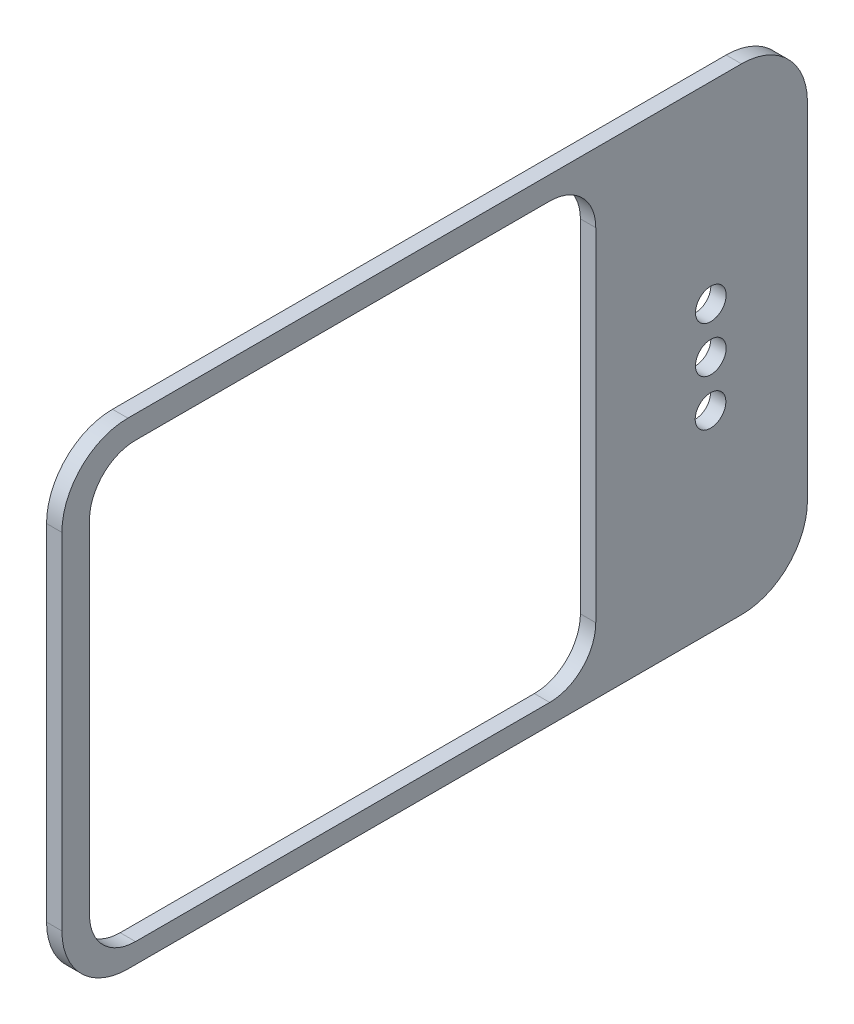
ISO-10303-21;
HEADER;
FILE_DESCRIPTION(('STEP AP214'),'2;1');
FILE_NAME('part.step','',(''),(''),'','','');
FILE_SCHEMA(('AUTOMOTIVE_DESIGN { 1 0 10303 214 1 1 1 1 }'));
ENDSEC;
DATA;
#1=APPLICATION_CONTEXT('core data for automotive mechanical design processes');
#2=APPLICATION_PROTOCOL_DEFINITION('international standard','automotive_design',2000,#1);
#3=PRODUCT_CONTEXT('',#1,'mechanical');
#4=PRODUCT('Part','Part','',(#3));
#5=PRODUCT_RELATED_PRODUCT_CATEGORY('part','',(#4));
#6=PRODUCT_DEFINITION_FORMATION('','',#4);
#7=PRODUCT_DEFINITION_CONTEXT('part definition',#1,'design');
#8=PRODUCT_DEFINITION('design','',#6,#7);
#9=PRODUCT_DEFINITION_SHAPE('','',#8);
#10=(LENGTH_UNIT() NAMED_UNIT(*) SI_UNIT(.MILLI.,.METRE.));
#11=(NAMED_UNIT(*) PLANE_ANGLE_UNIT() SI_UNIT($,.RADIAN.));
#12=(NAMED_UNIT(*) SI_UNIT($,.STERADIAN.) SOLID_ANGLE_UNIT());
#13=UNCERTAINTY_MEASURE_WITH_UNIT(LENGTH_MEASURE(1.E-05),#10,'distance_accuracy_value','');
#14=(GEOMETRIC_REPRESENTATION_CONTEXT(3) GLOBAL_UNCERTAINTY_ASSIGNED_CONTEXT((#13)) GLOBAL_UNIT_ASSIGNED_CONTEXT((#10,
#11,#12)) REPRESENTATION_CONTEXT('',''));
#15=CARTESIAN_POINT('',(0.,0.,0.));
#16=DIRECTION('',(0.,0.,1.));
#17=DIRECTION('',(1.,0.,0.));
#18=AXIS2_PLACEMENT_3D('',#15,#16,#17);
#19=CARTESIAN_POINT('',(1.,-1.74753460069684,-22.5098061573546));
#20=DIRECTION('',(-1.,0.,0.));
#21=DIRECTION('',(0.,0.,1.));
#22=AXIS2_PLACEMENT_3D('',#19,#20,#21);
#23=CYLINDRICAL_SURFACE('',#22,4.3);
#24=CARTESIAN_POINT('',(0.,-1.74753460069684,-22.5098061573546));
#25=DIRECTION('',(1.,0.,0.));
#26=DIRECTION('',(0.,0.,-1.));
#27=AXIS2_PLACEMENT_3D('',#24,#25,#26);
#28=CIRCLE('',#27,4.3);
#29=CARTESIAN_POINT('',(0.,-6.04753460069684,-22.5098061573546));
#30=VERTEX_POINT('',#29);
#31=CARTESIAN_POINT('',(0.,-1.74753460069684,-26.8098061573546));
#32=VERTEX_POINT('',#31);
#33=EDGE_CURVE('E212',#30,#32,#28,.T.);
#34=ORIENTED_EDGE('',*,*,#33,.T.);
#35=DIRECTION('',(-1.,0.,0.));
#36=VECTOR('',#35,1.);
#37=CARTESIAN_POINT('',(1.,-1.74753460069684,-26.8098061573546));
#38=LINE('',#37,#36);
#39=CARTESIAN_POINT('',(1.,-1.74753460069684,-26.8098061573546));
#40=VERTEX_POINT('',#39);
#41=EDGE_CURVE('E11',#40,#32,#38,.T.);
#42=ORIENTED_EDGE('',*,*,#41,.F.);
#43=CARTESIAN_POINT('',(1.,-1.74753460069684,-22.5098061573546));
#44=DIRECTION('',(1.,0.,0.));
#45=DIRECTION('',(0.,0.,-1.));
#46=AXIS2_PLACEMENT_3D('',#43,#44,#45);
#47=CIRCLE('',#46,4.3);
#48=CARTESIAN_POINT('',(1.,-6.04753460069684,-22.5098061573546));
#49=VERTEX_POINT('',#48);
#50=EDGE_CURVE('E224',#49,#40,#47,.T.);
#51=ORIENTED_EDGE('',*,*,#50,.F.);
#52=DIRECTION('',(-1.,0.,0.));
#53=VECTOR('',#52,1.);
#54=CARTESIAN_POINT('',(1.,-6.04753460069684,-22.5098061573546));
#55=LINE('',#54,#53);
#56=EDGE_CURVE('E242',#49,#30,#55,.T.);
#57=ORIENTED_EDGE('',*,*,#56,.T.);
#58=EDGE_LOOP('',(#34,#42,#51,#57));
#59=FACE_BOUND('',#58,.T.);
#60=ADVANCED_FACE('F39',(#59),#23,.T.);
#61=CARTESIAN_POINT('',(1.,-1.74753460069684,-26.8098061573546));
#62=DIRECTION('',(0.,0.,1.));
#63=DIRECTION('',(0.,-1.,0.));
#64=AXIS2_PLACEMENT_3D('',#61,#62,#63);
#65=PLANE('',#64);
#66=DIRECTION('',(0.,1.,0.));
#67=VECTOR('',#66,1.);
#68=CARTESIAN_POINT('',(0.,-1.74753460069684,-26.8098061573546));
#69=LINE('',#68,#67);
#70=CARTESIAN_POINT('',(0.,20.7524653993032,-26.8098061573546));
#71=VERTEX_POINT('',#70);
#72=EDGE_CURVE('E245',#32,#71,#69,.T.);
#73=ORIENTED_EDGE('',*,*,#72,.T.);
#74=DIRECTION('',(-1.,0.,0.));
#75=VECTOR('',#74,1.);
#76=CARTESIAN_POINT('',(1.,20.7524653993032,-26.8098061573546));
#77=LINE('',#76,#75);
#78=CARTESIAN_POINT('',(1.,20.7524653993032,-26.8098061573546));
#79=VERTEX_POINT('',#78);
#80=EDGE_CURVE('E46',#79,#71,#77,.T.);
#81=ORIENTED_EDGE('',*,*,#80,.F.);
#82=DIRECTION('',(0.,1.,0.));
#83=VECTOR('',#82,1.);
#84=CARTESIAN_POINT('',(1.,-1.74753460069684,-26.8098061573546));
#85=LINE('',#84,#83);
#86=EDGE_CURVE('E227',#40,#79,#85,.T.);
#87=ORIENTED_EDGE('',*,*,#86,.F.);
#88=ORIENTED_EDGE('',*,*,#41,.T.);
#89=EDGE_LOOP('',(#73,#81,#87,#88));
#90=FACE_BOUND('',#89,.T.);
#91=ADVANCED_FACE('F300',(#90),#65,.F.);
#92=CARTESIAN_POINT('',(1.,20.7524653993032,-22.5098061573546));
#93=DIRECTION('',(-1.,0.,0.));
#94=DIRECTION('',(0.,0.,1.));
#95=AXIS2_PLACEMENT_3D('',#92,#93,#94);
#96=CYLINDRICAL_SURFACE('',#95,4.3);
#97=CARTESIAN_POINT('',(0.,20.7524653993032,-22.5098061573546));
#98=DIRECTION('',(1.,0.,0.));
#99=DIRECTION('',(0.,0.,-1.));
#100=AXIS2_PLACEMENT_3D('',#97,#98,#99);
#101=CIRCLE('',#100,4.3);
#102=CARTESIAN_POINT('',(0.,25.0524653993032,-22.5098061573546));
#103=VERTEX_POINT('',#102);
#104=EDGE_CURVE('E247',#71,#103,#101,.T.);
#105=ORIENTED_EDGE('',*,*,#104,.T.);
#106=DIRECTION('',(-1.,0.,0.));
#107=VECTOR('',#106,1.);
#108=CARTESIAN_POINT('',(1.,25.0524653993032,-22.5098061573546));
#109=LINE('',#108,#107);
#110=CARTESIAN_POINT('',(1.,25.0524653993032,-22.5098061573546));
#111=VERTEX_POINT('',#110);
#112=EDGE_CURVE('E272',#111,#103,#109,.T.);
#113=ORIENTED_EDGE('',*,*,#112,.F.);
#114=CARTESIAN_POINT('',(1.,20.7524653993032,-22.5098061573546));
#115=DIRECTION('',(1.,0.,0.));
#116=DIRECTION('',(0.,0.,-1.));
#117=AXIS2_PLACEMENT_3D('',#114,#115,#116);
#118=CIRCLE('',#117,4.3);
#119=EDGE_CURVE('E230',#79,#111,#118,.T.);
#120=ORIENTED_EDGE('',*,*,#119,.F.);
#121=ORIENTED_EDGE('',*,*,#80,.T.);
#122=EDGE_LOOP('',(#105,#113,#120,#121));
#123=FACE_BOUND('',#122,.T.);
#124=ADVANCED_FACE('F279',(#123),#96,.T.);
#125=CARTESIAN_POINT('',(1.,25.0524653993032,-22.5098061573546));
#126=DIRECTION('',(0.,-1.,0.));
#127=DIRECTION('',(0.,0.,-1.));
#128=AXIS2_PLACEMENT_3D('',#125,#126,#127);
#129=PLANE('',#128);
#130=DIRECTION('',(0.,0.,1.));
#131=VECTOR('',#130,1.);
#132=CARTESIAN_POINT('',(0.,25.0524653993032,-22.5098061573546));
#133=LINE('',#132,#131);
#134=CARTESIAN_POINT('',(0.,25.0524653993032,17.4901938426454));
#135=VERTEX_POINT('',#134);
#136=EDGE_CURVE('E249',#103,#135,#133,.T.);
#137=ORIENTED_EDGE('',*,*,#136,.T.);
#138=DIRECTION('',(-1.,0.,0.));
#139=VECTOR('',#138,1.);
#140=CARTESIAN_POINT('',(1.,25.0524653993032,17.4901938426454));
#141=LINE('',#140,#139);
#142=CARTESIAN_POINT('',(1.,25.0524653993032,17.4901938426454));
#143=VERTEX_POINT('',#142);
#144=EDGE_CURVE('E269',#143,#135,#141,.T.);
#145=ORIENTED_EDGE('',*,*,#144,.F.);
#146=DIRECTION('',(0.,0.,1.));
#147=VECTOR('',#146,1.);
#148=CARTESIAN_POINT('',(1.,25.0524653993032,-22.5098061573546));
#149=LINE('',#148,#147);
#150=EDGE_CURVE('E232',#111,#143,#149,.T.);
#151=ORIENTED_EDGE('',*,*,#150,.F.);
#152=ORIENTED_EDGE('',*,*,#112,.T.);
#153=EDGE_LOOP('',(#137,#145,#151,#152));
#154=FACE_BOUND('',#153,.T.);
#155=ADVANCED_FACE('F290',(#154),#129,.F.);
#156=CARTESIAN_POINT('',(1.,20.7524653993032,17.4901938426454));
#157=DIRECTION('',(-1.,0.,0.));
#158=DIRECTION('',(0.,0.,1.));
#159=AXIS2_PLACEMENT_3D('',#156,#157,#158);
#160=CYLINDRICAL_SURFACE('',#159,4.3);
#161=CARTESIAN_POINT('',(0.,20.7524653993032,17.4901938426454));
#162=DIRECTION('',(1.,0.,0.));
#163=DIRECTION('',(0.,0.,-1.));
#164=AXIS2_PLACEMENT_3D('',#161,#162,#163);
#165=CIRCLE('',#164,4.3);
#166=CARTESIAN_POINT('',(0.,20.7524653993032,21.7901938426454));
#167=VERTEX_POINT('',#166);
#168=EDGE_CURVE('E251',#135,#167,#165,.T.);
#169=ORIENTED_EDGE('',*,*,#168,.T.);
#170=DIRECTION('',(-1.,0.,0.));
#171=VECTOR('',#170,1.);
#172=CARTESIAN_POINT('',(1.,20.7524653993032,21.7901938426454));
#173=LINE('',#172,#171);
#174=CARTESIAN_POINT('',(1.,20.7524653993032,21.7901938426454));
#175=VERTEX_POINT('',#174);
#176=EDGE_CURVE('E266',#175,#167,#173,.T.);
#177=ORIENTED_EDGE('',*,*,#176,.F.);
#178=CARTESIAN_POINT('',(1.,20.7524653993032,17.4901938426454));
#179=DIRECTION('',(1.,0.,0.));
#180=DIRECTION('',(0.,0.,-1.));
#181=AXIS2_PLACEMENT_3D('',#178,#179,#180);
#182=CIRCLE('',#181,4.3);
#183=EDGE_CURVE('E234',#143,#175,#182,.T.);
#184=ORIENTED_EDGE('',*,*,#183,.F.);
#185=ORIENTED_EDGE('',*,*,#144,.T.);
#186=EDGE_LOOP('',(#169,#177,#184,#185));
#187=FACE_BOUND('',#186,.T.);
#188=ADVANCED_FACE('F294',(#187),#160,.T.);
#189=CARTESIAN_POINT('',(1.,20.7524653993032,21.7901938426454));
#190=DIRECTION('',(0.,0.,-1.));
#191=DIRECTION('',(-1.,0.,0.));
#192=AXIS2_PLACEMENT_3D('',#189,#190,#191);
#193=PLANE('',#192);
#194=DIRECTION('',(0.,-1.,0.));
#195=VECTOR('',#194,1.);
#196=CARTESIAN_POINT('',(0.,20.7524653993032,21.7901938426454));
#197=LINE('',#196,#195);
#198=CARTESIAN_POINT('',(0.,-1.74753460069685,21.7901938426454));
#199=VERTEX_POINT('',#198);
#200=EDGE_CURVE('E253',#167,#199,#197,.T.);
#201=ORIENTED_EDGE('',*,*,#200,.T.);
#202=DIRECTION('',(-1.,0.,0.));
#203=VECTOR('',#202,1.);
#204=CARTESIAN_POINT('',(1.,-1.74753460069685,21.7901938426454));
#205=LINE('',#204,#203);
#206=CARTESIAN_POINT('',(1.,-1.74753460069685,21.7901938426454));
#207=VERTEX_POINT('',#206);
#208=EDGE_CURVE('E263',#207,#199,#205,.T.);
#209=ORIENTED_EDGE('',*,*,#208,.F.);
#210=DIRECTION('',(0.,-1.,0.));
#211=VECTOR('',#210,1.);
#212=CARTESIAN_POINT('',(1.,20.7524653993032,21.7901938426454));
#213=LINE('',#212,#211);
#214=EDGE_CURVE('E236',#175,#207,#213,.T.);
#215=ORIENTED_EDGE('',*,*,#214,.F.);
#216=ORIENTED_EDGE('',*,*,#176,.T.);
#217=EDGE_LOOP('',(#201,#209,#215,#216));
#218=FACE_BOUND('',#217,.T.);
#219=ADVANCED_FACE('F313',(#218),#193,.F.);
#220=CARTESIAN_POINT('',(1.,-1.74753460069685,17.4901938426454));
#221=DIRECTION('',(-1.,0.,0.));
#222=DIRECTION('',(0.,0.,1.));
#223=AXIS2_PLACEMENT_3D('',#220,#221,#222);
#224=CYLINDRICAL_SURFACE('',#223,4.30000000000001);
#225=CARTESIAN_POINT('',(0.,-1.74753460069685,17.4901938426454));
#226=DIRECTION('',(1.,0.,0.));
#227=DIRECTION('',(0.,0.,-1.));
#228=AXIS2_PLACEMENT_3D('',#225,#226,#227);
#229=CIRCLE('',#228,4.30000000000001);
#230=CARTESIAN_POINT('',(0.,-6.04753460069685,17.4901938426454));
#231=VERTEX_POINT('',#230);
#232=EDGE_CURVE('E255',#199,#231,#229,.T.);
#233=ORIENTED_EDGE('',*,*,#232,.T.);
#234=DIRECTION('',(-1.,0.,0.));
#235=VECTOR('',#234,1.);
#236=CARTESIAN_POINT('',(1.,-6.04753460069685,17.4901938426454));
#237=LINE('',#236,#235);
#238=CARTESIAN_POINT('',(1.,-6.04753460069685,17.4901938426454));
#239=VERTEX_POINT('',#238);
#240=EDGE_CURVE('E260',#239,#231,#237,.T.);
#241=ORIENTED_EDGE('',*,*,#240,.F.);
#242=CARTESIAN_POINT('',(1.,-1.74753460069685,17.4901938426454));
#243=DIRECTION('',(1.,0.,0.));
#244=DIRECTION('',(0.,0.,-1.));
#245=AXIS2_PLACEMENT_3D('',#242,#243,#244);
#246=CIRCLE('',#245,4.30000000000001);
#247=EDGE_CURVE('E238',#207,#239,#246,.T.);
#248=ORIENTED_EDGE('',*,*,#247,.F.);
#249=ORIENTED_EDGE('',*,*,#208,.T.);
#250=EDGE_LOOP('',(#233,#241,#248,#249));
#251=FACE_BOUND('',#250,.T.);
#252=ADVANCED_FACE('F311',(#251),#224,.T.);
#253=CARTESIAN_POINT('',(1.,-6.04753460069685,17.4901938426454));
#254=DIRECTION('',(0.,1.,0.));
#255=DIRECTION('',(0.,0.,1.));
#256=AXIS2_PLACEMENT_3D('',#253,#254,#255);
#257=PLANE('',#256);
#258=DIRECTION('',(0.,0.,-1.));
#259=VECTOR('',#258,1.);
#260=CARTESIAN_POINT('',(0.,-6.04753460069685,17.4901938426454));
#261=LINE('',#260,#259);
#262=EDGE_CURVE('E228',#231,#30,#261,.T.);
#263=ORIENTED_EDGE('',*,*,#262,.T.);
#264=ORIENTED_EDGE('',*,*,#56,.F.);
#265=DIRECTION('',(0.,0.,-1.));
#266=VECTOR('',#265,1.);
#267=CARTESIAN_POINT('',(1.,-6.04753460069685,17.4901938426454));
#268=LINE('',#267,#266);
#269=EDGE_CURVE('E240',#239,#49,#268,.T.);
#270=ORIENTED_EDGE('',*,*,#269,.F.);
#271=ORIENTED_EDGE('',*,*,#240,.T.);
#272=EDGE_LOOP('',(#263,#264,#270,#271));
#273=FACE_BOUND('',#272,.T.);
#274=ADVANCED_FACE('F306',(#273),#257,.F.);
#275=CARTESIAN_POINT('',(1.,-1.74753460069684,-22.5098061573546));
#276=DIRECTION('',(1.,0.,0.));
#277=DIRECTION('',(0.,0.,-1.));
#278=AXIS2_PLACEMENT_3D('',#275,#276,#277);
#279=PLANE('',#278);
#280=CARTESIAN_POINT('',(1.,6.49433255645243,-20.4913205756208));
#281=DIRECTION('',(-1.,0.,0.));
#282=DIRECTION('',(0.,0.,1.));
#283=AXIS2_PLACEMENT_3D('',#280,#281,#282);
#284=CIRCLE('',#283,1.);
#285=CARTESIAN_POINT('',(1.,6.49433255645243,-19.4913205756208));
#286=VERTEX_POINT('',#285);
#287=EDGE_CURVE('E544',#286,#286,#284,.T.);
#288=ORIENTED_EDGE('',*,*,#287,.T.);
#289=EDGE_LOOP('',(#288));
#290=FACE_BOUND('',#289,.T.);
#291=CARTESIAN_POINT('',(1.,12.5024653993032,-20.5098061573546));
#292=DIRECTION('',(-1.,0.,0.));
#293=DIRECTION('',(0.,0.,1.));
#294=AXIS2_PLACEMENT_3D('',#291,#292,#293);
#295=CIRCLE('',#294,1.);
#296=CARTESIAN_POINT('',(1.,12.5024653993032,-19.5098061573546));
#297=VERTEX_POINT('',#296);
#298=EDGE_CURVE('E548',#297,#297,#295,.T.);
#299=ORIENTED_EDGE('',*,*,#298,.T.);
#300=EDGE_LOOP('',(#299));
#301=FACE_BOUND('',#300,.T.);
#302=CARTESIAN_POINT('',(1.,9.50246539930316,-20.5098061573546));
#303=DIRECTION('',(-1.,0.,0.));
#304=DIRECTION('',(0.,0.,1.));
#305=AXIS2_PLACEMENT_3D('',#302,#303,#304);
#306=CIRCLE('',#305,1.);
#307=CARTESIAN_POINT('',(1.,9.50246539930316,-19.5098061573546));
#308=VERTEX_POINT('',#307);
#309=EDGE_CURVE('E194',#308,#308,#306,.T.);
#310=ORIENTED_EDGE('',*,*,#309,.T.);
#311=EDGE_LOOP('',(#310));
#312=FACE_BOUND('',#311,.T.);
#313=CARTESIAN_POINT('',(1.,20.5524653993032,-10.0098061573546));
#314=DIRECTION('',(-1.,0.,0.));
#315=DIRECTION('',(0.,0.,1.));
#316=AXIS2_PLACEMENT_3D('',#313,#314,#315);
#317=CIRCLE('',#316,3.);
#318=CARTESIAN_POINT('',(1.,23.5524653993032,-10.0098061573546));
#319=VERTEX_POINT('',#318);
#320=CARTESIAN_POINT('',(1.,20.5524653993032,-13.0098061573546));
#321=VERTEX_POINT('',#320);
#322=EDGE_CURVE('E153',#319,#321,#317,.T.);
#323=ORIENTED_EDGE('',*,*,#322,.T.);
#324=DIRECTION('',(0.,-1.,0.));
#325=VECTOR('',#324,1.);
#326=CARTESIAN_POINT('',(1.,20.5524653993032,-13.0098061573546));
#327=LINE('',#326,#325);
#328=CARTESIAN_POINT('',(1.,-1.74753460069684,-13.0098061573546));
#329=VERTEX_POINT('',#328);
#330=EDGE_CURVE('E162',#321,#329,#327,.T.);
#331=ORIENTED_EDGE('',*,*,#330,.T.);
#332=CARTESIAN_POINT('',(1.,-1.74753460069684,-10.0098061573546));
#333=DIRECTION('',(-1.,0.,0.));
#334=DIRECTION('',(0.,0.,1.));
#335=AXIS2_PLACEMENT_3D('',#332,#333,#334);
#336=CIRCLE('',#335,3.);
#337=CARTESIAN_POINT('',(1.,-4.74753460069685,-10.0098061573546));
#338=VERTEX_POINT('',#337);
#339=EDGE_CURVE('E53',#329,#338,#336,.T.);
#340=ORIENTED_EDGE('',*,*,#339,.T.);
#341=DIRECTION('',(0.,0.,1.));
#342=VECTOR('',#341,1.);
#343=CARTESIAN_POINT('',(1.,-4.74753460069685,-10.0098061573546));
#344=LINE('',#343,#342);
#345=CARTESIAN_POINT('',(1.,-4.74753460069685,16.9901938426454));
#346=VERTEX_POINT('',#345);
#347=EDGE_CURVE('E180',#338,#346,#344,.T.);
#348=ORIENTED_EDGE('',*,*,#347,.T.);
#349=CARTESIAN_POINT('',(1.,-1.74753460069685,16.9901938426454));
#350=DIRECTION('',(-1.,0.,0.));
#351=DIRECTION('',(0.,0.,1.));
#352=AXIS2_PLACEMENT_3D('',#349,#350,#351);
#353=CIRCLE('',#352,3.);
#354=CARTESIAN_POINT('',(1.,-1.74753460069685,19.9901938426454));
#355=VERTEX_POINT('',#354);
#356=EDGE_CURVE('E183',#346,#355,#353,.T.);
#357=ORIENTED_EDGE('',*,*,#356,.T.);
#358=DIRECTION('',(0.,1.,0.));
#359=VECTOR('',#358,1.);
#360=CARTESIAN_POINT('',(1.,-1.74753460069685,19.9901938426454));
#361=LINE('',#360,#359);
#362=CARTESIAN_POINT('',(1.,20.5524653993032,19.9901938426454));
#363=VERTEX_POINT('',#362);
#364=EDGE_CURVE('E186',#355,#363,#361,.T.);
#365=ORIENTED_EDGE('',*,*,#364,.T.);
#366=CARTESIAN_POINT('',(1.,20.5524653993032,16.9901938426454));
#367=DIRECTION('',(-1.,0.,0.));
#368=DIRECTION('',(0.,0.,1.));
#369=AXIS2_PLACEMENT_3D('',#366,#367,#368);
#370=CIRCLE('',#369,3.);
#371=CARTESIAN_POINT('',(1.,23.5524653993032,16.9901938426454));
#372=VERTEX_POINT('',#371);
#373=EDGE_CURVE('E189',#363,#372,#370,.T.);
#374=ORIENTED_EDGE('',*,*,#373,.T.);
#375=DIRECTION('',(0.,0.,-1.));
#376=VECTOR('',#375,1.);
#377=CARTESIAN_POINT('',(1.,23.5524653993032,16.9901938426454));
#378=LINE('',#377,#376);
#379=EDGE_CURVE('E159',#372,#319,#378,.T.);
#380=ORIENTED_EDGE('',*,*,#379,.T.);
#381=EDGE_LOOP('',(#323,#331,#340,#348,#357,#365,#374,#380));
#382=FACE_BOUND('',#381,.T.);
#383=ORIENTED_EDGE('',*,*,#50,.T.);
#384=ORIENTED_EDGE('',*,*,#86,.T.);
#385=ORIENTED_EDGE('',*,*,#119,.T.);
#386=ORIENTED_EDGE('',*,*,#150,.T.);
#387=ORIENTED_EDGE('',*,*,#183,.T.);
#388=ORIENTED_EDGE('',*,*,#214,.T.);
#389=ORIENTED_EDGE('',*,*,#247,.T.);
#390=ORIENTED_EDGE('',*,*,#269,.T.);
#391=EDGE_LOOP('',(#383,#384,#385,#386,#387,#388,#389,#390));
#392=FACE_BOUND('',#391,.T.);
#393=ADVANCED_FACE('F166',(#290,#301,#312,#382,#392),#279,.T.);
#394=CARTESIAN_POINT('',(0.,-1.74753460069684,-22.5098061573546));
#395=DIRECTION('',(1.,0.,0.));
#396=DIRECTION('',(0.,0.,-1.));
#397=AXIS2_PLACEMENT_3D('',#394,#395,#396);
#398=PLANE('',#397);
#399=CARTESIAN_POINT('',(0.,6.49433255645243,-20.4913205756208));
#400=DIRECTION('',(-1.,0.,0.));
#401=DIRECTION('',(0.,0.,1.));
#402=AXIS2_PLACEMENT_3D('',#399,#400,#401);
#403=CIRCLE('',#402,1.);
#404=CARTESIAN_POINT('',(0.,6.49433255645243,-19.4913205756208));
#405=VERTEX_POINT('',#404);
#406=EDGE_CURVE('E547',#405,#405,#403,.T.);
#407=ORIENTED_EDGE('',*,*,#406,.F.);
#408=EDGE_LOOP('',(#407));
#409=FACE_BOUND('',#408,.T.);
#410=CARTESIAN_POINT('',(0.,12.5024653993032,-20.5098061573546));
#411=DIRECTION('',(-1.,0.,0.));
#412=DIRECTION('',(0.,0.,1.));
#413=AXIS2_PLACEMENT_3D('',#410,#411,#412);
#414=CIRCLE('',#413,1.);
#415=CARTESIAN_POINT('',(0.,12.5024653993032,-19.5098061573546));
#416=VERTEX_POINT('',#415);
#417=EDGE_CURVE('E551',#416,#416,#414,.T.);
#418=ORIENTED_EDGE('',*,*,#417,.F.);
#419=EDGE_LOOP('',(#418));
#420=FACE_BOUND('',#419,.T.);
#421=CARTESIAN_POINT('',(0.,9.50246539930316,-20.5098061573546));
#422=DIRECTION('',(-1.,0.,0.));
#423=DIRECTION('',(0.,0.,1.));
#424=AXIS2_PLACEMENT_3D('',#421,#422,#423);
#425=CIRCLE('',#424,1.);
#426=CARTESIAN_POINT('',(0.,9.50246539930316,-19.5098061573546));
#427=VERTEX_POINT('',#426);
#428=EDGE_CURVE('E176',#427,#427,#425,.T.);
#429=ORIENTED_EDGE('',*,*,#428,.F.);
#430=EDGE_LOOP('',(#429));
#431=FACE_BOUND('',#430,.T.);
#432=DIRECTION('',(0.,-1.,0.));
#433=VECTOR('',#432,1.);
#434=CARTESIAN_POINT('',(0.,20.5524653993032,-13.0098061573546));
#435=LINE('',#434,#433);
#436=CARTESIAN_POINT('',(0.,20.5524653993032,-13.0098061573546));
#437=VERTEX_POINT('',#436);
#438=CARTESIAN_POINT('',(0.,-1.74753460069684,-13.0098061573546));
#439=VERTEX_POINT('',#438);
#440=EDGE_CURVE('E193',#437,#439,#435,.T.);
#441=ORIENTED_EDGE('',*,*,#440,.F.);
#442=CARTESIAN_POINT('',(0.,20.5524653993032,-10.0098061573546));
#443=DIRECTION('',(-1.,0.,0.));
#444=DIRECTION('',(0.,0.,1.));
#445=AXIS2_PLACEMENT_3D('',#442,#443,#444);
#446=CIRCLE('',#445,3.);
#447=CARTESIAN_POINT('',(0.,23.5524653993032,-10.0098061573546));
#448=VERTEX_POINT('',#447);
#449=EDGE_CURVE('E61',#448,#437,#446,.T.);
#450=ORIENTED_EDGE('',*,*,#449,.F.);
#451=DIRECTION('',(0.,0.,-1.));
#452=VECTOR('',#451,1.);
#453=CARTESIAN_POINT('',(0.,23.5524653993032,16.9901938426454));
#454=LINE('',#453,#452);
#455=CARTESIAN_POINT('',(0.,23.5524653993032,16.9901938426454));
#456=VERTEX_POINT('',#455);
#457=EDGE_CURVE('E170',#456,#448,#454,.T.);
#458=ORIENTED_EDGE('',*,*,#457,.F.);
#459=CARTESIAN_POINT('',(0.,20.5524653993032,16.9901938426454));
#460=DIRECTION('',(-1.,0.,0.));
#461=DIRECTION('',(0.,0.,1.));
#462=AXIS2_PLACEMENT_3D('',#459,#460,#461);
#463=CIRCLE('',#462,3.);
#464=CARTESIAN_POINT('',(0.,20.5524653993032,19.9901938426454));
#465=VERTEX_POINT('',#464);
#466=EDGE_CURVE('E173',#465,#456,#463,.T.);
#467=ORIENTED_EDGE('',*,*,#466,.F.);
#468=DIRECTION('',(0.,1.,0.));
#469=VECTOR('',#468,1.);
#470=CARTESIAN_POINT('',(0.,-1.74753460069685,19.9901938426454));
#471=LINE('',#470,#469);
#472=CARTESIAN_POINT('',(0.,-1.74753460069685,19.9901938426454));
#473=VERTEX_POINT('',#472);
#474=EDGE_CURVE('E205',#473,#465,#471,.T.);
#475=ORIENTED_EDGE('',*,*,#474,.F.);
#476=CARTESIAN_POINT('',(0.,-1.74753460069685,16.9901938426454));
#477=DIRECTION('',(-1.,0.,0.));
#478=DIRECTION('',(0.,0.,1.));
#479=AXIS2_PLACEMENT_3D('',#476,#477,#478);
#480=CIRCLE('',#479,3.);
#481=CARTESIAN_POINT('',(0.,-4.74753460069685,16.9901938426454));
#482=VERTEX_POINT('',#481);
#483=EDGE_CURVE('E202',#482,#473,#480,.T.);
#484=ORIENTED_EDGE('',*,*,#483,.F.);
#485=DIRECTION('',(0.,0.,1.));
#486=VECTOR('',#485,1.);
#487=CARTESIAN_POINT('',(0.,-4.74753460069685,-10.0098061573546));
#488=LINE('',#487,#486);
#489=CARTESIAN_POINT('',(0.,-4.74753460069685,-10.0098061573546));
#490=VERTEX_POINT('',#489);
#491=EDGE_CURVE('E199',#490,#482,#488,.T.);
#492=ORIENTED_EDGE('',*,*,#491,.F.);
#493=CARTESIAN_POINT('',(0.,-1.74753460069684,-10.0098061573546));
#494=DIRECTION('',(-1.,0.,0.));
#495=DIRECTION('',(0.,0.,1.));
#496=AXIS2_PLACEMENT_3D('',#493,#494,#495);
#497=CIRCLE('',#496,3.);
#498=EDGE_CURVE('E196',#439,#490,#497,.T.);
#499=ORIENTED_EDGE('',*,*,#498,.F.);
#500=EDGE_LOOP('',(#441,#450,#458,#467,#475,#484,#492,#499));
#501=FACE_BOUND('',#500,.T.);
#502=ORIENTED_EDGE('',*,*,#33,.F.);
#503=ORIENTED_EDGE('',*,*,#262,.F.);
#504=ORIENTED_EDGE('',*,*,#232,.F.);
#505=ORIENTED_EDGE('',*,*,#200,.F.);
#506=ORIENTED_EDGE('',*,*,#168,.F.);
#507=ORIENTED_EDGE('',*,*,#136,.F.);
#508=ORIENTED_EDGE('',*,*,#104,.F.);
#509=ORIENTED_EDGE('',*,*,#72,.F.);
#510=EDGE_LOOP('',(#502,#503,#504,#505,#506,#507,#508,#509));
#511=FACE_BOUND('',#510,.T.);
#512=ADVANCED_FACE('F285',(#409,#420,#431,#501,#511),#398,.F.);
#513=CARTESIAN_POINT('',(1.,20.5524653993032,-10.0098061573546));
#514=DIRECTION('',(-1.,0.,0.));
#515=DIRECTION('',(0.,0.,1.));
#516=AXIS2_PLACEMENT_3D('',#513,#514,#515);
#517=CYLINDRICAL_SURFACE('',#516,3.);
#518=ORIENTED_EDGE('',*,*,#449,.T.);
#519=DIRECTION('',(-1.,0.,0.));
#520=VECTOR('',#519,1.);
#521=CARTESIAN_POINT('',(1.,20.5524653993032,-13.0098061573546));
#522=LINE('',#521,#520);
#523=EDGE_CURVE('E149',#321,#437,#522,.T.);
#524=ORIENTED_EDGE('',*,*,#523,.F.);
#525=ORIENTED_EDGE('',*,*,#322,.F.);
#526=DIRECTION('',(-1.,0.,0.));
#527=VECTOR('',#526,1.);
#528=CARTESIAN_POINT('',(1.,23.5524653993032,-10.0098061573546));
#529=LINE('',#528,#527);
#530=EDGE_CURVE('E210',#319,#448,#529,.T.);
#531=ORIENTED_EDGE('',*,*,#530,.T.);
#532=EDGE_LOOP('',(#518,#524,#525,#531));
#533=FACE_BOUND('',#532,.T.);
#534=ADVANCED_FACE('F151',(#533),#517,.F.);
#535=CARTESIAN_POINT('',(1.,23.5524653993032,16.9901938426454));
#536=DIRECTION('',(0.,1.,0.));
#537=DIRECTION('',(0.,0.,1.));
#538=AXIS2_PLACEMENT_3D('',#535,#536,#537);
#539=PLANE('',#538);
#540=ORIENTED_EDGE('',*,*,#457,.T.);
#541=ORIENTED_EDGE('',*,*,#530,.F.);
#542=ORIENTED_EDGE('',*,*,#379,.F.);
#543=DIRECTION('',(-1.,0.,0.));
#544=VECTOR('',#543,1.);
#545=CARTESIAN_POINT('',(1.,23.5524653993032,16.9901938426454));
#546=LINE('',#545,#544);
#547=EDGE_CURVE('E213',#372,#456,#546,.T.);
#548=ORIENTED_EDGE('',*,*,#547,.T.);
#549=EDGE_LOOP('',(#540,#541,#542,#548));
#550=FACE_BOUND('',#549,.T.);
#551=ADVANCED_FACE('F373',(#550),#539,.F.);
#552=CARTESIAN_POINT('',(1.,20.5524653993032,16.9901938426454));
#553=DIRECTION('',(-1.,0.,0.));
#554=DIRECTION('',(0.,0.,1.));
#555=AXIS2_PLACEMENT_3D('',#552,#553,#554);
#556=CYLINDRICAL_SURFACE('',#555,3.);
#557=ORIENTED_EDGE('',*,*,#466,.T.);
#558=ORIENTED_EDGE('',*,*,#547,.F.);
#559=ORIENTED_EDGE('',*,*,#373,.F.);
#560=DIRECTION('',(-1.,0.,0.));
#561=VECTOR('',#560,1.);
#562=CARTESIAN_POINT('',(1.,20.5524653993032,19.9901938426454));
#563=LINE('',#562,#561);
#564=EDGE_CURVE('E215',#363,#465,#563,.T.);
#565=ORIENTED_EDGE('',*,*,#564,.T.);
#566=EDGE_LOOP('',(#557,#558,#559,#565));
#567=FACE_BOUND('',#566,.T.);
#568=ADVANCED_FACE('F385',(#567),#556,.F.);
#569=CARTESIAN_POINT('',(1.,-1.74753460069685,19.9901938426454));
#570=DIRECTION('',(0.,0.,1.));
#571=DIRECTION('',(0.,-1.,0.));
#572=AXIS2_PLACEMENT_3D('',#569,#570,#571);
#573=PLANE('',#572);
#574=ORIENTED_EDGE('',*,*,#474,.T.);
#575=ORIENTED_EDGE('',*,*,#564,.F.);
#576=ORIENTED_EDGE('',*,*,#364,.F.);
#577=DIRECTION('',(-1.,0.,0.));
#578=VECTOR('',#577,1.);
#579=CARTESIAN_POINT('',(1.,-1.74753460069685,19.9901938426454));
#580=LINE('',#579,#578);
#581=EDGE_CURVE('E217',#355,#473,#580,.T.);
#582=ORIENTED_EDGE('',*,*,#581,.T.);
#583=EDGE_LOOP('',(#574,#575,#576,#582));
#584=FACE_BOUND('',#583,.T.);
#585=ADVANCED_FACE('F396',(#584),#573,.F.);
#586=CARTESIAN_POINT('',(1.,-1.74753460069685,16.9901938426454));
#587=DIRECTION('',(-1.,0.,0.));
#588=DIRECTION('',(0.,0.,1.));
#589=AXIS2_PLACEMENT_3D('',#586,#587,#588);
#590=CYLINDRICAL_SURFACE('',#589,3.);
#591=ORIENTED_EDGE('',*,*,#483,.T.);
#592=ORIENTED_EDGE('',*,*,#581,.F.);
#593=ORIENTED_EDGE('',*,*,#356,.F.);
#594=DIRECTION('',(-1.,0.,0.));
#595=VECTOR('',#594,1.);
#596=CARTESIAN_POINT('',(1.,-4.74753460069685,16.9901938426454));
#597=LINE('',#596,#595);
#598=EDGE_CURVE('E219',#346,#482,#597,.T.);
#599=ORIENTED_EDGE('',*,*,#598,.T.);
#600=EDGE_LOOP('',(#591,#592,#593,#599));
#601=FACE_BOUND('',#600,.T.);
#602=ADVANCED_FACE('F407',(#601),#590,.F.);
#603=CARTESIAN_POINT('',(1.,-4.74753460069685,-10.0098061573546));
#604=DIRECTION('',(0.,-1.,0.));
#605=DIRECTION('',(0.,0.,-1.));
#606=AXIS2_PLACEMENT_3D('',#603,#604,#605);
#607=PLANE('',#606);
#608=ORIENTED_EDGE('',*,*,#491,.T.);
#609=ORIENTED_EDGE('',*,*,#598,.F.);
#610=ORIENTED_EDGE('',*,*,#347,.F.);
#611=DIRECTION('',(-1.,0.,0.));
#612=VECTOR('',#611,1.);
#613=CARTESIAN_POINT('',(1.,-4.74753460069685,-10.0098061573546));
#614=LINE('',#613,#612);
#615=EDGE_CURVE('E221',#338,#490,#614,.T.);
#616=ORIENTED_EDGE('',*,*,#615,.T.);
#617=EDGE_LOOP('',(#608,#609,#610,#616));
#618=FACE_BOUND('',#617,.T.);
#619=ADVANCED_FACE('F418',(#618),#607,.F.);
#620=CARTESIAN_POINT('',(1.,-1.74753460069684,-10.0098061573546));
#621=DIRECTION('',(-1.,0.,0.));
#622=DIRECTION('',(0.,0.,1.));
#623=AXIS2_PLACEMENT_3D('',#620,#621,#622);
#624=CYLINDRICAL_SURFACE('',#623,3.);
#625=ORIENTED_EDGE('',*,*,#498,.T.);
#626=ORIENTED_EDGE('',*,*,#615,.F.);
#627=ORIENTED_EDGE('',*,*,#339,.F.);
#628=DIRECTION('',(-1.,0.,0.));
#629=VECTOR('',#628,1.);
#630=CARTESIAN_POINT('',(1.,-1.74753460069684,-13.0098061573546));
#631=LINE('',#630,#629);
#632=EDGE_CURVE('E158',#329,#439,#631,.T.);
#633=ORIENTED_EDGE('',*,*,#632,.T.);
#634=EDGE_LOOP('',(#625,#626,#627,#633));
#635=FACE_BOUND('',#634,.T.);
#636=ADVANCED_FACE('F429',(#635),#624,.F.);
#637=CARTESIAN_POINT('',(1.,20.5524653993032,-13.0098061573546));
#638=DIRECTION('',(0.,0.,-1.));
#639=DIRECTION('',(0.,1.,0.));
#640=AXIS2_PLACEMENT_3D('',#637,#638,#639);
#641=PLANE('',#640);
#642=ORIENTED_EDGE('',*,*,#440,.T.);
#643=ORIENTED_EDGE('',*,*,#632,.F.);
#644=ORIENTED_EDGE('',*,*,#330,.F.);
#645=ORIENTED_EDGE('',*,*,#523,.T.);
#646=EDGE_LOOP('',(#642,#643,#644,#645));
#647=FACE_BOUND('',#646,.T.);
#648=ADVANCED_FACE('F163',(#647),#641,.F.);
#649=CARTESIAN_POINT('',(1.,9.50246539930316,-20.5098061573546));
#650=DIRECTION('',(-1.,0.,0.));
#651=DIRECTION('',(0.,0.,1.));
#652=AXIS2_PLACEMENT_3D('',#649,#650,#651);
#653=CYLINDRICAL_SURFACE('',#652,1.);
#654=ORIENTED_EDGE('',*,*,#309,.F.);
#655=EDGE_LOOP('',(#654));
#656=FACE_BOUND('',#655,.T.);
#657=ORIENTED_EDGE('',*,*,#428,.T.);
#658=EDGE_LOOP('',(#657));
#659=FACE_BOUND('',#658,.T.);
#660=ADVANCED_FACE('F449',(#656,#659),#653,.F.);
#661=CARTESIAN_POINT('',(1.,12.5024653993032,-20.5098061573546));
#662=DIRECTION('',(-1.,0.,0.));
#663=DIRECTION('',(0.,0.,1.));
#664=AXIS2_PLACEMENT_3D('',#661,#662,#663);
#665=CYLINDRICAL_SURFACE('',#664,1.);
#666=ORIENTED_EDGE('',*,*,#298,.F.);
#667=EDGE_LOOP('',(#666));
#668=FACE_BOUND('',#667,.T.);
#669=ORIENTED_EDGE('',*,*,#417,.T.);
#670=EDGE_LOOP('',(#669));
#671=FACE_BOUND('',#670,.T.);
#672=ADVANCED_FACE('F475',(#668,#671),#665,.F.);
#673=CARTESIAN_POINT('',(1.,6.49433255645243,-20.4913205756208));
#674=DIRECTION('',(-1.,0.,0.));
#675=DIRECTION('',(0.,0.,1.));
#676=AXIS2_PLACEMENT_3D('',#673,#674,#675);
#677=CYLINDRICAL_SURFACE('',#676,1.);
#678=ORIENTED_EDGE('',*,*,#287,.F.);
#679=EDGE_LOOP('',(#678));
#680=FACE_BOUND('',#679,.T.);
#681=ORIENTED_EDGE('',*,*,#406,.T.);
#682=EDGE_LOOP('',(#681));
#683=FACE_BOUND('',#682,.T.);
#684=ADVANCED_FACE('F486',(#680,#683),#677,.F.);
#685=CLOSED_SHELL('',(#60,#91,#124,#155,#188,#219,#252,#274,#393,#512,#534,#551,#568,#585,#602,
#619,#636,#648,#660,#672,#684));
#686=MANIFOLD_SOLID_BREP('B2',#685);
#687=ADVANCED_BREP_SHAPE_REPRESENTATION('',(#18,#686),#14);
#688=SHAPE_DEFINITION_REPRESENTATION(#9,#687);
ENDSEC;
END-ISO-10303-21;
